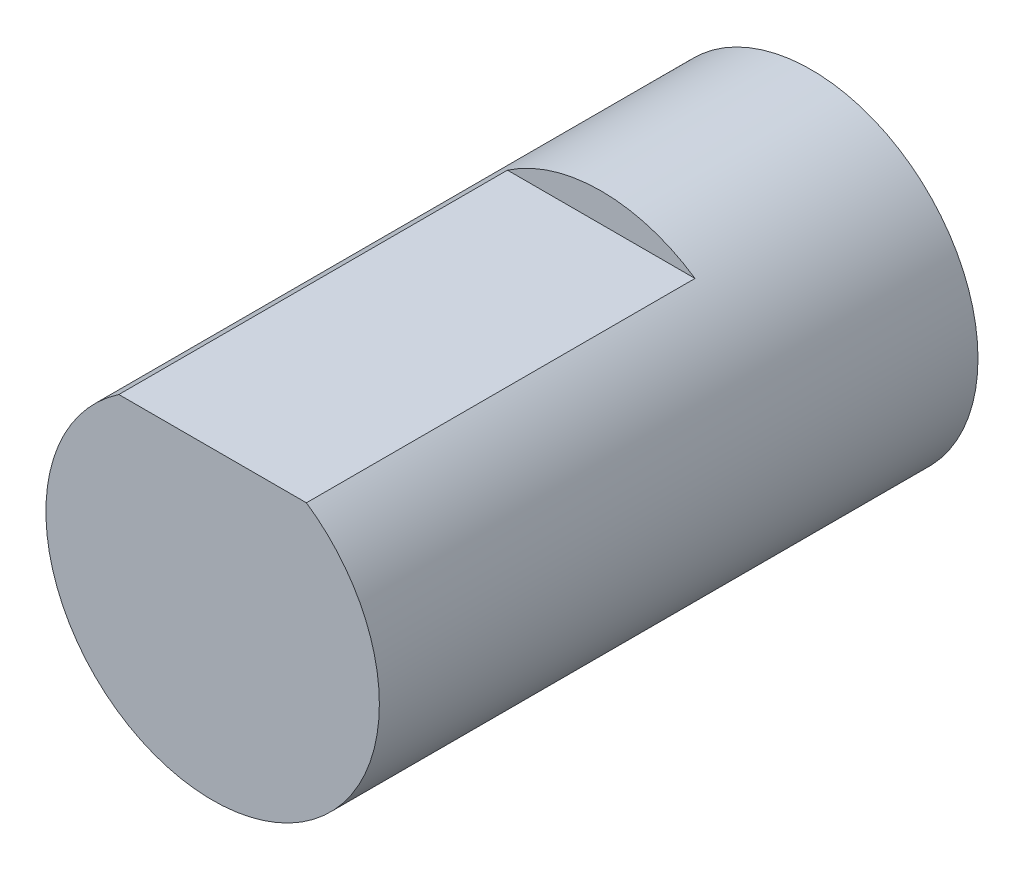
ISO-10303-21;
HEADER;
FILE_DESCRIPTION(('STEP AP214'),'2;1');
FILE_NAME('part.step','',(''),(''),'','','');
FILE_SCHEMA(('AUTOMOTIVE_DESIGN { 1 0 10303 214 1 1 1 1 }'));
ENDSEC;
DATA;
#1=APPLICATION_CONTEXT('core data for automotive mechanical design processes');
#2=APPLICATION_PROTOCOL_DEFINITION('international standard','automotive_design',2000,#1);
#3=PRODUCT_CONTEXT('',#1,'mechanical');
#4=PRODUCT('Part','Part','',(#3));
#5=PRODUCT_RELATED_PRODUCT_CATEGORY('part','',(#4));
#6=PRODUCT_DEFINITION_FORMATION('','',#4);
#7=PRODUCT_DEFINITION_CONTEXT('part definition',#1,'design');
#8=PRODUCT_DEFINITION('design','',#6,#7);
#9=PRODUCT_DEFINITION_SHAPE('','',#8);
#10=(LENGTH_UNIT() NAMED_UNIT(*) SI_UNIT(.MILLI.,.METRE.));
#11=(NAMED_UNIT(*) PLANE_ANGLE_UNIT() SI_UNIT($,.RADIAN.));
#12=(NAMED_UNIT(*) SI_UNIT($,.STERADIAN.) SOLID_ANGLE_UNIT());
#13=UNCERTAINTY_MEASURE_WITH_UNIT(LENGTH_MEASURE(1.E-05),#10,'distance_accuracy_value','');
#14=(GEOMETRIC_REPRESENTATION_CONTEXT(3) GLOBAL_UNCERTAINTY_ASSIGNED_CONTEXT((#13)) GLOBAL_UNIT_ASSIGNED_CONTEXT((#10,
#11,#12)) REPRESENTATION_CONTEXT('',''));
#15=CARTESIAN_POINT('',(0.,0.,0.));
#16=DIRECTION('',(0.,0.,1.));
#17=DIRECTION('',(1.,0.,0.));
#18=AXIS2_PLACEMENT_3D('',#15,#16,#17);
#19=CARTESIAN_POINT('',(-2.5,2.625,15.6));
#20=DIRECTION('',(0.,-1.,0.));
#21=DIRECTION('',(0.,0.,-1.));
#22=AXIS2_PLACEMENT_3D('',#19,#20,#21);
#23=PLANE('',#22);
#24=DIRECTION('',(-1.,0.,0.));
#25=VECTOR('',#24,1.);
#26=CARTESIAN_POINT('',(-2.5,2.625,23.));
#27=LINE('',#26,#25);
#28=CARTESIAN_POINT('',(1.78605710994927,2.62499999999994,23.));
#29=VERTEX_POINT('',#28);
#30=CARTESIAN_POINT('',(-1.78605710994917,2.625,23.));
#31=VERTEX_POINT('',#30);
#32=EDGE_CURVE('E55',#29,#31,#27,.T.);
#33=ORIENTED_EDGE('',*,*,#32,.F.);
#34=DIRECTION('',(0.,0.,1.));
#35=VECTOR('',#34,1.);
#36=CARTESIAN_POINT('',(1.78605710994917,2.625,30.6));
#37=LINE('',#36,#35);
#38=CARTESIAN_POINT('',(1.78605710994917,2.625,15.6));
#39=VERTEX_POINT('',#38);
#40=EDGE_CURVE('E72',#39,#29,#37,.T.);
#41=ORIENTED_EDGE('',*,*,#40,.F.);
#42=DIRECTION('',(1.,0.,0.));
#43=VECTOR('',#42,1.);
#44=CARTESIAN_POINT('',(-2.5,2.625,15.6));
#45=LINE('',#44,#43);
#46=CARTESIAN_POINT('',(-1.78605710994917,2.625,15.6));
#47=VERTEX_POINT('',#46);
#48=EDGE_CURVE('E61',#47,#39,#45,.T.);
#49=ORIENTED_EDGE('',*,*,#48,.F.);
#50=DIRECTION('',(0.,0.,1.));
#51=VECTOR('',#50,1.);
#52=CARTESIAN_POINT('',(-1.78605710994917,2.625,30.6));
#53=LINE('',#52,#51);
#54=EDGE_CURVE('E74',#31,#47,#53,.F.);
#55=ORIENTED_EDGE('',*,*,#54,.F.);
#56=EDGE_LOOP('',(#33,#41,#49,#55));
#57=FACE_BOUND('',#56,.T.);
#58=ADVANCED_FACE('F41',(#57),#23,.F.);
#59=CARTESIAN_POINT('',(0.,0.,30.6));
#60=DIRECTION('',(0.,0.,1.));
#61=DIRECTION('',(1.,0.,0.));
#62=AXIS2_PLACEMENT_3D('',#59,#60,#61);
#63=CYLINDRICAL_SURFACE('',#62,3.175);
#64=CARTESIAN_POINT('',(0.,0.,11.6));
#65=DIRECTION('',(0.,0.,1.));
#66=DIRECTION('',(1.,0.,0.));
#67=AXIS2_PLACEMENT_3D('',#64,#65,#66);
#68=CIRCLE('',#67,3.175);
#69=CARTESIAN_POINT('',(3.175,0.,11.6));
#70=VERTEX_POINT('',#69);
#71=EDGE_CURVE('E49',#70,#70,#68,.T.);
#72=ORIENTED_EDGE('',*,*,#71,.T.);
#73=EDGE_LOOP('',(#72));
#74=FACE_BOUND('',#73,.T.);
#75=ORIENTED_EDGE('',*,*,#40,.T.);
#76=CARTESIAN_POINT('',(0.,0.,23.));
#77=DIRECTION('',(0.,0.,1.));
#78=DIRECTION('',(1.,0.,0.));
#79=AXIS2_PLACEMENT_3D('',#76,#77,#78);
#80=CIRCLE('',#79,3.175);
#81=EDGE_CURVE('E11',#29,#31,#80,.F.);
#82=ORIENTED_EDGE('',*,*,#81,.T.);
#83=ORIENTED_EDGE('',*,*,#54,.T.);
#84=CARTESIAN_POINT('',(0.,0.,15.6));
#85=DIRECTION('',(0.,0.,1.));
#86=DIRECTION('',(1.,0.,0.));
#87=AXIS2_PLACEMENT_3D('',#84,#85,#86);
#88=CIRCLE('',#87,3.175);
#89=EDGE_CURVE('E77',#47,#39,#88,.F.);
#90=ORIENTED_EDGE('',*,*,#89,.T.);
#91=EDGE_LOOP('',(#75,#82,#83,#90));
#92=FACE_BOUND('',#91,.T.);
#93=ADVANCED_FACE('F76',(#74,#92),#63,.T.);
#94=CARTESIAN_POINT('',(-2.5,4.,15.6));
#95=DIRECTION('',(0.,0.,-1.));
#96=DIRECTION('',(-1.,0.,0.));
#97=AXIS2_PLACEMENT_3D('',#94,#95,#96);
#98=PLANE('',#97);
#99=ORIENTED_EDGE('',*,*,#89,.F.);
#100=ORIENTED_EDGE('',*,*,#48,.T.);
#101=EDGE_LOOP('',(#99,#100));
#102=FACE_BOUND('',#101,.T.);
#103=ADVANCED_FACE('F43',(#102),#98,.F.);
#104=CARTESIAN_POINT('',(0.,0.,11.6));
#105=DIRECTION('',(0.,0.,1.));
#106=DIRECTION('',(1.,0.,0.));
#107=AXIS2_PLACEMENT_3D('',#104,#105,#106);
#108=PLANE('',#107);
#109=ORIENTED_EDGE('',*,*,#71,.F.);
#110=EDGE_LOOP('',(#109));
#111=FACE_BOUND('',#110,.T.);
#112=ADVANCED_FACE('F84',(#111),#108,.F.);
#113=CARTESIAN_POINT('',(0.,0.,23.));
#114=DIRECTION('',(0.,0.,1.));
#115=DIRECTION('',(1.,0.,0.));
#116=AXIS2_PLACEMENT_3D('',#113,#114,#115);
#117=PLANE('',#116);
#118=ORIENTED_EDGE('',*,*,#32,.T.);
#119=ORIENTED_EDGE('',*,*,#81,.F.);
#120=EDGE_LOOP('',(#118,#119));
#121=FACE_BOUND('',#120,.T.);
#122=ADVANCED_FACE('F67',(#121),#117,.T.);
#123=CLOSED_SHELL('',(#58,#93,#103,#112,#122));
#124=MANIFOLD_SOLID_BREP('B2',#123);
#125=ADVANCED_BREP_SHAPE_REPRESENTATION('',(#18,#124),#14);
#126=SHAPE_DEFINITION_REPRESENTATION(#9,#125);
ENDSEC;
END-ISO-10303-21;
